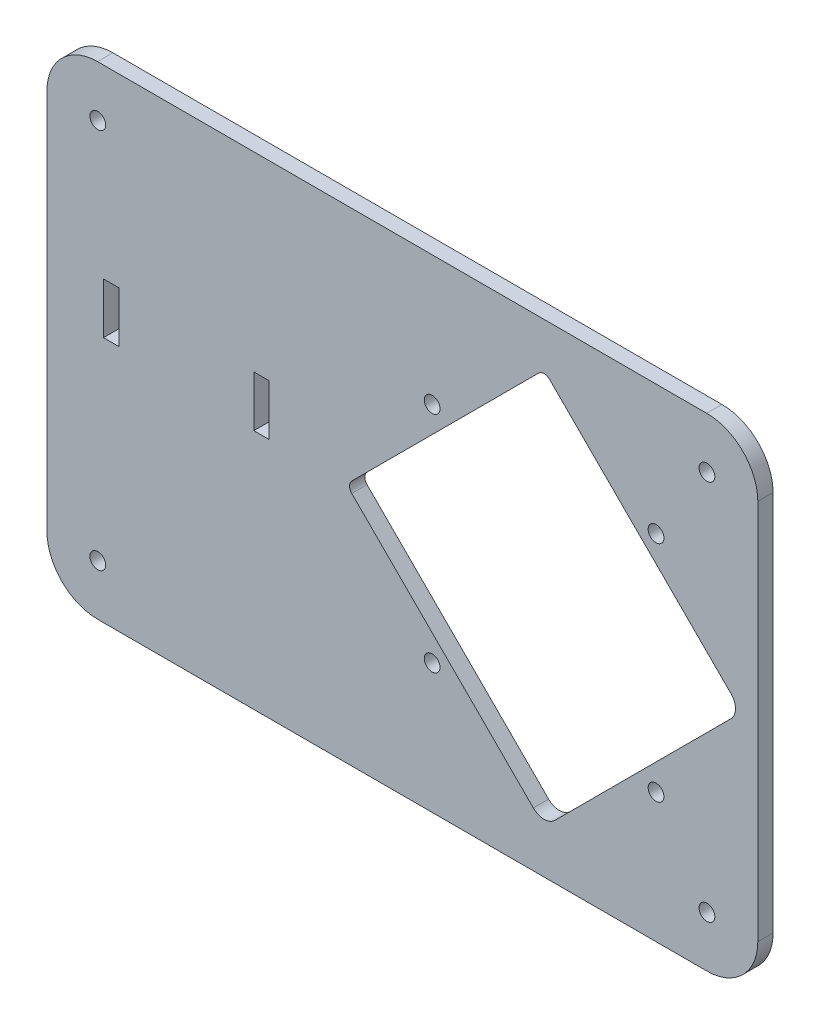
ISO-10303-21;
HEADER;
FILE_DESCRIPTION(('STEP AP214'),'2;1');
FILE_NAME('part.step','',(''),(''),'','','');
FILE_SCHEMA(('AUTOMOTIVE_DESIGN { 1 0 10303 214 1 1 1 1 }'));
ENDSEC;
DATA;
#1=APPLICATION_CONTEXT('core data for automotive mechanical design processes');
#2=APPLICATION_PROTOCOL_DEFINITION('international standard','automotive_design',2000,#1);
#3=PRODUCT_CONTEXT('',#1,'mechanical');
#4=PRODUCT('Part','Part','',(#3));
#5=PRODUCT_RELATED_PRODUCT_CATEGORY('part','',(#4));
#6=PRODUCT_DEFINITION_FORMATION('','',#4);
#7=PRODUCT_DEFINITION_CONTEXT('part definition',#1,'design');
#8=PRODUCT_DEFINITION('design','',#6,#7);
#9=PRODUCT_DEFINITION_SHAPE('','',#8);
#10=(LENGTH_UNIT() NAMED_UNIT(*) SI_UNIT(.MILLI.,.METRE.));
#11=(NAMED_UNIT(*) PLANE_ANGLE_UNIT() SI_UNIT($,.RADIAN.));
#12=(NAMED_UNIT(*) SI_UNIT($,.STERADIAN.) SOLID_ANGLE_UNIT());
#13=UNCERTAINTY_MEASURE_WITH_UNIT(LENGTH_MEASURE(1.E-05),#10,'distance_accuracy_value','');
#14=(GEOMETRIC_REPRESENTATION_CONTEXT(3) GLOBAL_UNCERTAINTY_ASSIGNED_CONTEXT((#13)) GLOBAL_UNIT_ASSIGNED_CONTEXT((#10,
#11,#12)) REPRESENTATION_CONTEXT('',''));
#15=CARTESIAN_POINT('',(0.,0.,0.));
#16=DIRECTION('',(0.,0.,1.));
#17=DIRECTION('',(1.,0.,0.));
#18=AXIS2_PLACEMENT_3D('',#15,#16,#17);
#19=CARTESIAN_POINT('',(15.6947795706554,1.1526691371013,3.));
#20=DIRECTION('',(0.,0.,1.));
#21=DIRECTION('',(1.,0.,0.));
#22=AXIS2_PLACEMENT_3D('',#19,#20,#21);
#23=PLANE('',#22);
#24=CARTESIAN_POINT('',(15.6947795706554,76.0577426574191,3.));
#25=DIRECTION('',(0.,0.,1.));
#26=DIRECTION('',(1.,0.,0.));
#27=AXIS2_PLACEMENT_3D('',#24,#25,#26);
#28=CIRCLE('',#27,1.55000000312162);
#29=CARTESIAN_POINT('',(17.244779573777,76.0577426574191,3.));
#30=VERTEX_POINT('',#29);
#31=EDGE_CURVE('E701',#30,#30,#28,.T.);
#32=ORIENTED_EDGE('',*,*,#31,.F.);
#33=EDGE_LOOP('',(#32));
#34=FACE_BOUND('',#33,.T.);
#35=CARTESIAN_POINT('',(135.394779570655,76.0577426574191,3.));
#36=DIRECTION('',(0.,0.,1.));
#37=DIRECTION('',(1.,0.,0.));
#38=AXIS2_PLACEMENT_3D('',#35,#36,#37);
#39=CIRCLE('',#38,1.55000000312162);
#40=CARTESIAN_POINT('',(136.944779573777,76.0577426574191,3.));
#41=VERTEX_POINT('',#40);
#42=EDGE_CURVE('E713',#41,#41,#39,.T.);
#43=ORIENTED_EDGE('',*,*,#42,.F.);
#44=EDGE_LOOP('',(#43));
#45=FACE_BOUND('',#44,.T.);
#46=CARTESIAN_POINT('',(125.394779569042,16.59999999969,3.));
#47=DIRECTION('',(0.,0.,1.));
#48=DIRECTION('',(1.,0.,0.));
#49=AXIS2_PLACEMENT_3D('',#46,#47,#48);
#50=CIRCLE('',#49,1.55000000161293);
#51=CARTESIAN_POINT('',(126.944779570655,16.59999999969,3.));
#52=VERTEX_POINT('',#51);
#53=EDGE_CURVE('E725',#52,#52,#50,.T.);
#54=ORIENTED_EDGE('',*,*,#53,.F.);
#55=EDGE_LOOP('',(#54));
#56=FACE_BOUND('',#55,.T.);
#57=CARTESIAN_POINT('',(81.3948795690424,16.5999999964642,3.));
#58=DIRECTION('',(0.,0.,1.));
#59=DIRECTION('',(1.,0.,0.));
#60=AXIS2_PLACEMENT_3D('',#57,#58,#59);
#61=CIRCLE('',#60,1.55000000161289);
#62=CARTESIAN_POINT('',(82.9448795706553,16.5999999964642,3.));
#63=VERTEX_POINT('',#62);
#64=EDGE_CURVE('E223',#63,#63,#61,.T.);
#65=ORIENTED_EDGE('',*,*,#64,.F.);
#66=EDGE_LOOP('',(#65));
#67=FACE_BOUND('',#66,.T.);
#68=CARTESIAN_POINT('',(15.6947795706554,1.1526691371013,3.));
#69=DIRECTION('',(0.,0.,1.));
#70=DIRECTION('',(1.,0.,0.));
#71=AXIS2_PLACEMENT_3D('',#68,#69,#70);
#72=CIRCLE('',#71,10.);
#73=CARTESIAN_POINT('',(5.69477957065543,1.15266913710129,3.));
#74=VERTEX_POINT('',#73);
#75=CARTESIAN_POINT('',(15.6947795706554,-8.84733086289874,3.));
#76=VERTEX_POINT('',#75);
#77=EDGE_CURVE('E323',#74,#76,#72,.T.);
#78=ORIENTED_EDGE('',*,*,#77,.T.);
#79=DIRECTION('',(1.,0.,0.));
#80=VECTOR('',#79,1.);
#81=CARTESIAN_POINT('',(15.6947795706554,-8.84733086289874,3.));
#82=LINE('',#81,#80);
#83=CARTESIAN_POINT('',(135.394779570655,-8.84733086289873,3.));
#84=VERTEX_POINT('',#83);
#85=EDGE_CURVE('E326',#76,#84,#82,.T.);
#86=ORIENTED_EDGE('',*,*,#85,.T.);
#87=CARTESIAN_POINT('',(135.394779570655,1.15266913710126,3.));
#88=DIRECTION('',(0.,0.,1.));
#89=DIRECTION('',(1.,0.,0.));
#90=AXIS2_PLACEMENT_3D('',#87,#88,#89);
#91=CIRCLE('',#90,9.99999999999999);
#92=CARTESIAN_POINT('',(145.394779570655,1.15266913710126,3.));
#93=VERTEX_POINT('',#92);
#94=EDGE_CURVE('E329',#84,#93,#91,.T.);
#95=ORIENTED_EDGE('',*,*,#94,.T.);
#96=DIRECTION('',(0.,1.,0.));
#97=VECTOR('',#96,1.);
#98=CARTESIAN_POINT('',(145.394779570655,76.0999776424039,3.));
#99=LINE('',#98,#97);
#100=CARTESIAN_POINT('',(145.394779570655,76.0999776424039,3.));
#101=VERTEX_POINT('',#100);
#102=EDGE_CURVE('E331',#93,#101,#99,.T.);
#103=ORIENTED_EDGE('',*,*,#102,.T.);
#104=CARTESIAN_POINT('',(135.394779570655,76.0577426574191,3.));
#105=DIRECTION('',(0.,0.,1.));
#106=DIRECTION('',(1.,0.,0.));
#107=AXIS2_PLACEMENT_3D('',#104,#105,#106);
#108=CIRCLE('',#107,10.0000891893001);
#109=CARTESIAN_POINT('',(135.352544585667,86.0577426574191,3.));
#110=VERTEX_POINT('',#109);
#111=EDGE_CURVE('E333',#101,#110,#108,.T.);
#112=ORIENTED_EDGE('',*,*,#111,.T.);
#113=DIRECTION('',(-1.,0.,0.));
#114=VECTOR('',#113,1.);
#115=CARTESIAN_POINT('',(15.6524445856688,86.0577426574191,3.));
#116=LINE('',#115,#114);
#117=CARTESIAN_POINT('',(15.6524445856688,86.0577426574191,3.));
#118=VERTEX_POINT('',#117);
#119=EDGE_CURVE('E335',#110,#118,#116,.T.);
#120=ORIENTED_EDGE('',*,*,#119,.T.);
#121=CARTESIAN_POINT('',(15.6947795706554,76.0577426574191,3.));
#122=DIRECTION('',(0.,0.,1.));
#123=DIRECTION('',(1.,0.,0.));
#124=AXIS2_PLACEMENT_3D('',#121,#122,#123);
#125=CIRCLE('',#124,10.0000896121462);
#126=CARTESIAN_POINT('',(5.69477957065542,76.1000776424078,3.));
#127=VERTEX_POINT('',#126);
#128=EDGE_CURVE('E337',#118,#127,#125,.T.);
#129=ORIENTED_EDGE('',*,*,#128,.T.);
#130=DIRECTION('',(0.,-1.,0.));
#131=VECTOR('',#130,1.);
#132=CARTESIAN_POINT('',(5.69477957065542,76.1000776424078,3.));
#133=LINE('',#132,#131);
#134=EDGE_CURVE('E339',#127,#74,#133,.T.);
#135=ORIENTED_EDGE('',*,*,#134,.T.);
#136=EDGE_LOOP('',(#78,#86,#95,#103,#112,#120,#129,#135));
#137=FACE_BOUND('',#136,.T.);
#138=DIRECTION('',(1.,0.,0.));
#139=VECTOR('',#138,1.);
#140=CARTESIAN_POINT('',(16.8158496285287,39.6610584653074,3.));
#141=LINE('',#140,#139);
#142=CARTESIAN_POINT('',(16.8158496285287,39.6610584653074,3.));
#143=VERTEX_POINT('',#142);
#144=CARTESIAN_POINT('',(19.8158496285287,39.6610584653074,3.));
#145=VERTEX_POINT('',#144);
#146=EDGE_CURVE('E294',#143,#145,#141,.T.);
#147=ORIENTED_EDGE('',*,*,#146,.F.);
#148=DIRECTION('',(0.,-1.,0.));
#149=VECTOR('',#148,1.);
#150=CARTESIAN_POINT('',(16.8158496285287,49.6610584653074,3.));
#151=LINE('',#150,#149);
#152=CARTESIAN_POINT('',(16.8158496285287,49.6610584653074,3.));
#153=VERTEX_POINT('',#152);
#154=EDGE_CURVE('E292',#153,#143,#151,.T.);
#155=ORIENTED_EDGE('',*,*,#154,.F.);
#156=DIRECTION('',(-1.,0.,0.));
#157=VECTOR('',#156,1.);
#158=CARTESIAN_POINT('',(16.8158496285287,49.6610584653074,3.));
#159=LINE('',#158,#157);
#160=CARTESIAN_POINT('',(19.8158496285287,49.6610584653074,3.));
#161=VERTEX_POINT('',#160);
#162=EDGE_CURVE('E300',#161,#153,#159,.T.);
#163=ORIENTED_EDGE('',*,*,#162,.F.);
#164=DIRECTION('',(0.,1.,0.));
#165=VECTOR('',#164,1.);
#166=CARTESIAN_POINT('',(19.8158496285287,49.6610584653074,3.));
#167=LINE('',#166,#165);
#168=EDGE_CURVE('E297',#145,#161,#167,.T.);
#169=ORIENTED_EDGE('',*,*,#168,.F.);
#170=EDGE_LOOP('',(#147,#155,#163,#169));
#171=FACE_BOUND('',#170,.T.);
#172=DIRECTION('',(0.707106781186547,0.707106781186548,0.));
#173=VECTOR('',#172,1.);
#174=CARTESIAN_POINT('',(105.516097101729,1.86631752915051,3.));
#175=LINE('',#174,#173);
#176=CARTESIAN_POINT('',(105.516097101729,1.86631752915051,3.));
#177=VERTEX_POINT('',#176);
#178=CARTESIAN_POINT('',(140.128859227096,36.4790796545173,3.));
#179=VERTEX_POINT('',#178);
#180=EDGE_CURVE('E235',#177,#179,#175,.T.);
#181=ORIENTED_EDGE('',*,*,#180,.F.);
#182=CARTESIAN_POINT('',(103.394776758169,3.98763787271016,3.));
#183=DIRECTION('',(0.,0.,1.));
#184=DIRECTION('',(1.,0.,0.));
#185=AXIS2_PLACEMENT_3D('',#182,#183,#184);
#186=CIRCLE('',#185,3.);
#187=CARTESIAN_POINT('',(101.273453005516,1.86632093824952,3.));
#188=VERTEX_POINT('',#187);
#189=EDGE_CURVE('E233',#188,#177,#186,.T.);
#190=ORIENTED_EDGE('',*,*,#189,.F.);
#191=DIRECTION('',(0.707105644820232,-0.707107917551037,0.));
#192=VECTOR('',#191,1.);
#193=CARTESIAN_POINT('',(101.273453005516,1.86632093824952,3.));
#194=LINE('',#193,#192);
#195=CARTESIAN_POINT('',(65.6001470716292,37.5397415308466,3.));
#196=VERTEX_POINT('',#195);
#197=EDGE_CURVE('E249',#196,#188,#194,.T.);
#198=ORIENTED_EDGE('',*,*,#197,.F.);
#199=CARTESIAN_POINT('',(66.6608089479557,38.600399998077,3.));
#200=DIRECTION('',(0.,0.,1.));
#201=DIRECTION('',(1.,0.,0.));
#202=AXIS2_PLACEMENT_3D('',#199,#200,#201);
#203=CIRCLE('',#202,1.49999999999999);
#204=CARTESIAN_POINT('',(65.6001470716292,39.6610584653074,3.));
#205=VERTEX_POINT('',#204);
#206=EDGE_CURVE('E246',#205,#196,#203,.T.);
#207=ORIENTED_EDGE('',*,*,#206,.F.);
#208=DIRECTION('',(-0.707105644820231,-0.707107917551037,0.));
#209=VECTOR('',#208,1.);
#210=CARTESIAN_POINT('',(65.6001470716292,39.6610584653074,3.));
#211=LINE('',#210,#209);
#212=CARTESIAN_POINT('',(102.334113177293,76.3951426387833,3.));
#213=VERTEX_POINT('',#212);
#214=EDGE_CURVE('E244',#213,#205,#211,.T.);
#215=ORIENTED_EDGE('',*,*,#214,.F.);
#216=CARTESIAN_POINT('',(103.39477505362,75.334484171553,3.));
#217=DIRECTION('',(0.,0.,1.));
#218=DIRECTION('',(1.,0.,0.));
#219=AXIS2_PLACEMENT_3D('',#216,#217,#218);
#220=CIRCLE('',#219,1.50000000000001);
#221=CARTESIAN_POINT('',(104.4554352254,76.3951443433329,3.));
#222=VERTEX_POINT('',#221);
#223=EDGE_CURVE('E242',#222,#213,#220,.T.);
#224=ORIENTED_EDGE('',*,*,#223,.F.);
#225=DIRECTION('',(-0.707106781186548,0.707106781186547,0.));
#226=VECTOR('',#225,1.);
#227=CARTESIAN_POINT('',(140.128859227096,40.7217203416366,3.));
#228=LINE('',#227,#226);
#229=CARTESIAN_POINT('',(140.128859227096,40.7217203416366,3.));
#230=VERTEX_POINT('',#229);
#231=EDGE_CURVE('E240',#230,#222,#228,.T.);
#232=ORIENTED_EDGE('',*,*,#231,.F.);
#233=CARTESIAN_POINT('',(138.007538883536,38.6003999980771,3.));
#234=DIRECTION('',(0.,0.,1.));
#235=DIRECTION('',(1.,0.,0.));
#236=AXIS2_PLACEMENT_3D('',#233,#234,#235);
#237=CIRCLE('',#236,3.);
#238=EDGE_CURVE('E238',#179,#230,#237,.T.);
#239=ORIENTED_EDGE('',*,*,#238,.F.);
#240=EDGE_LOOP('',(#181,#190,#198,#207,#215,#224,#232,#239));
#241=FACE_BOUND('',#240,.T.);
#242=DIRECTION('',(1.,0.,0.));
#243=VECTOR('',#242,1.);
#244=CARTESIAN_POINT('',(46.3485605389878,38.600399998077,3.));
#245=LINE('',#244,#243);
#246=CARTESIAN_POINT('',(46.3485605389878,38.600399998077,3.));
#247=VERTEX_POINT('',#246);
#248=CARTESIAN_POINT('',(49.3485605389878,38.600399998077,3.));
#249=VERTEX_POINT('',#248);
#250=EDGE_CURVE('E202',#247,#249,#245,.T.);
#251=ORIENTED_EDGE('',*,*,#250,.F.);
#252=DIRECTION('',(0.,-1.,0.));
#253=VECTOR('',#252,1.);
#254=CARTESIAN_POINT('',(46.3485605389878,48.600399998077,3.));
#255=LINE('',#254,#253);
#256=CARTESIAN_POINT('',(46.3485605389878,48.600399998077,3.));
#257=VERTEX_POINT('',#256);
#258=EDGE_CURVE('E194',#257,#247,#255,.T.);
#259=ORIENTED_EDGE('',*,*,#258,.F.);
#260=DIRECTION('',(-1.,0.,0.));
#261=VECTOR('',#260,1.);
#262=CARTESIAN_POINT('',(46.3485605389878,48.600399998077,3.));
#263=LINE('',#262,#261);
#264=CARTESIAN_POINT('',(49.3485605389878,48.600399998077,3.));
#265=VERTEX_POINT('',#264);
#266=EDGE_CURVE('E217',#265,#257,#263,.T.);
#267=ORIENTED_EDGE('',*,*,#266,.F.);
#268=DIRECTION('',(0.,1.,0.));
#269=VECTOR('',#268,1.);
#270=CARTESIAN_POINT('',(49.3485605389878,48.600399998077,3.));
#271=LINE('',#270,#269);
#272=EDGE_CURVE('E215',#249,#265,#271,.T.);
#273=ORIENTED_EDGE('',*,*,#272,.F.);
#274=EDGE_LOOP('',(#251,#259,#267,#273));
#275=FACE_BOUND('',#274,.T.);
#276=CARTESIAN_POINT('',(81.3947295748109,60.600050001613,3.));
#277=DIRECTION('',(0.,0.,1.));
#278=DIRECTION('',(1.,0.,0.));
#279=AXIS2_PLACEMENT_3D('',#276,#277,#278);
#280=CIRCLE('',#279,1.5500000016129);
#281=CARTESIAN_POINT('',(82.9447295764238,60.600050001613,3.));
#282=VERTEX_POINT('',#281);
#283=EDGE_CURVE('E731',#282,#282,#280,.T.);
#284=ORIENTED_EDGE('',*,*,#283,.F.);
#285=EDGE_LOOP('',(#284));
#286=FACE_BOUND('',#285,.T.);
#287=CARTESIAN_POINT('',(125.394879569042,60.5999999964642,3.));
#288=DIRECTION('',(0.,0.,1.));
#289=DIRECTION('',(1.,0.,0.));
#290=AXIS2_PLACEMENT_3D('',#287,#288,#289);
#291=CIRCLE('',#290,1.55000000161284);
#292=CARTESIAN_POINT('',(126.944879570655,60.5999999964642,3.));
#293=VERTEX_POINT('',#292);
#294=EDGE_CURVE('E719',#293,#293,#291,.T.);
#295=ORIENTED_EDGE('',*,*,#294,.F.);
#296=EDGE_LOOP('',(#295));
#297=FACE_BOUND('',#296,.T.);
#298=CARTESIAN_POINT('',(135.394779570655,1.15266913710126,3.));
#299=DIRECTION('',(0.,0.,1.));
#300=DIRECTION('',(1.,0.,0.));
#301=AXIS2_PLACEMENT_3D('',#298,#299,#300);
#302=CIRCLE('',#301,1.55000000312165);
#303=CARTESIAN_POINT('',(136.944779573777,1.15266913710126,3.));
#304=VERTEX_POINT('',#303);
#305=EDGE_CURVE('E707',#304,#304,#302,.T.);
#306=ORIENTED_EDGE('',*,*,#305,.F.);
#307=EDGE_LOOP('',(#306));
#308=FACE_BOUND('',#307,.T.);
#309=CARTESIAN_POINT('',(15.6947795706554,1.1526691371013,3.));
#310=DIRECTION('',(0.,0.,1.));
#311=DIRECTION('',(1.,0.,0.));
#312=AXIS2_PLACEMENT_3D('',#309,#310,#311);
#313=CIRCLE('',#312,1.55);
#314=CARTESIAN_POINT('',(17.2447795706554,1.1526691371013,3.));
#315=VERTEX_POINT('',#314);
#316=EDGE_CURVE('E692',#315,#315,#313,.T.);
#317=ORIENTED_EDGE('',*,*,#316,.F.);
#318=EDGE_LOOP('',(#317));
#319=FACE_BOUND('',#318,.T.);
#320=ADVANCED_FACE('F33',(#34,#45,#56,#67,#137,#171,#241,#275,#286,#297,#308,#319),#23,.T.);
#321=CARTESIAN_POINT('',(15.6947795706554,1.1526691371013,0.));
#322=DIRECTION('',(0.,0.,1.));
#323=DIRECTION('',(1.,0.,0.));
#324=AXIS2_PLACEMENT_3D('',#321,#322,#323);
#325=PLANE('',#324);
#326=CARTESIAN_POINT('',(103.394776758169,3.98763787271016,0.));
#327=DIRECTION('',(0.,0.,1.));
#328=DIRECTION('',(1.,0.,0.));
#329=AXIS2_PLACEMENT_3D('',#326,#327,#328);
#330=CIRCLE('',#329,3.);
#331=CARTESIAN_POINT('',(101.273453005516,1.86632093824952,0.));
#332=VERTEX_POINT('',#331);
#333=CARTESIAN_POINT('',(105.516097101729,1.86631752915051,0.));
#334=VERTEX_POINT('',#333);
#335=EDGE_CURVE('E210',#332,#334,#330,.T.);
#336=ORIENTED_EDGE('',*,*,#335,.T.);
#337=DIRECTION('',(0.707106781186547,0.707106781186548,0.));
#338=VECTOR('',#337,1.);
#339=CARTESIAN_POINT('',(105.516097101729,1.86631752915051,0.));
#340=LINE('',#339,#338);
#341=CARTESIAN_POINT('',(140.128859227096,36.4790796545173,0.));
#342=VERTEX_POINT('',#341);
#343=EDGE_CURVE('E254',#334,#342,#340,.T.);
#344=ORIENTED_EDGE('',*,*,#343,.T.);
#345=CARTESIAN_POINT('',(138.007538883536,38.6003999980771,0.));
#346=DIRECTION('',(0.,0.,1.));
#347=DIRECTION('',(1.,0.,0.));
#348=AXIS2_PLACEMENT_3D('',#345,#346,#347);
#349=CIRCLE('',#348,3.);
#350=CARTESIAN_POINT('',(140.128859227096,40.7217203416366,0.));
#351=VERTEX_POINT('',#350);
#352=EDGE_CURVE('E257',#342,#351,#349,.T.);
#353=ORIENTED_EDGE('',*,*,#352,.T.);
#354=DIRECTION('',(-0.707106781186548,0.707106781186547,0.));
#355=VECTOR('',#354,1.);
#356=CARTESIAN_POINT('',(140.128859227096,40.7217203416366,0.));
#357=LINE('',#356,#355);
#358=CARTESIAN_POINT('',(104.4554352254,76.3951443433329,0.));
#359=VERTEX_POINT('',#358);
#360=EDGE_CURVE('E260',#351,#359,#357,.T.);
#361=ORIENTED_EDGE('',*,*,#360,.T.);
#362=CARTESIAN_POINT('',(103.39477505362,75.334484171553,0.));
#363=DIRECTION('',(0.,0.,1.));
#364=DIRECTION('',(1.,0.,0.));
#365=AXIS2_PLACEMENT_3D('',#362,#363,#364);
#366=CIRCLE('',#365,1.50000000000001);
#367=CARTESIAN_POINT('',(102.334113177293,76.3951426387833,0.));
#368=VERTEX_POINT('',#367);
#369=EDGE_CURVE('E263',#359,#368,#366,.T.);
#370=ORIENTED_EDGE('',*,*,#369,.T.);
#371=DIRECTION('',(-0.707105644820231,-0.707107917551037,0.));
#372=VECTOR('',#371,1.);
#373=CARTESIAN_POINT('',(65.6001470716292,39.6610584653074,0.));
#374=LINE('',#373,#372);
#375=CARTESIAN_POINT('',(65.6001470716292,39.6610584653074,0.));
#376=VERTEX_POINT('',#375);
#377=EDGE_CURVE('E266',#368,#376,#374,.T.);
#378=ORIENTED_EDGE('',*,*,#377,.T.);
#379=CARTESIAN_POINT('',(66.6608089479557,38.600399998077,0.));
#380=DIRECTION('',(0.,0.,1.));
#381=DIRECTION('',(1.,0.,0.));
#382=AXIS2_PLACEMENT_3D('',#379,#380,#381);
#383=CIRCLE('',#382,1.49999999999999);
#384=CARTESIAN_POINT('',(65.6001470716292,37.5397415308466,0.));
#385=VERTEX_POINT('',#384);
#386=EDGE_CURVE('E269',#376,#385,#383,.T.);
#387=ORIENTED_EDGE('',*,*,#386,.T.);
#388=DIRECTION('',(0.707105644820232,-0.707107917551037,0.));
#389=VECTOR('',#388,1.);
#390=CARTESIAN_POINT('',(101.273453005516,1.86632093824952,0.));
#391=LINE('',#390,#389);
#392=EDGE_CURVE('E236',#385,#332,#391,.T.);
#393=ORIENTED_EDGE('',*,*,#392,.T.);
#394=EDGE_LOOP('',(#336,#344,#353,#361,#370,#378,#387,#393));
#395=FACE_BOUND('',#394,.T.);
#396=CARTESIAN_POINT('',(15.6947795706554,1.1526691371013,0.));
#397=DIRECTION('',(0.,0.,1.));
#398=DIRECTION('',(1.,0.,0.));
#399=AXIS2_PLACEMENT_3D('',#396,#397,#398);
#400=CIRCLE('',#399,10.);
#401=CARTESIAN_POINT('',(5.69477957065543,1.15266913710129,0.));
#402=VERTEX_POINT('',#401);
#403=CARTESIAN_POINT('',(15.6947795706554,-8.84733086289874,0.));
#404=VERTEX_POINT('',#403);
#405=EDGE_CURVE('E322',#402,#404,#400,.T.);
#406=ORIENTED_EDGE('',*,*,#405,.F.);
#407=DIRECTION('',(0.,-1.,0.));
#408=VECTOR('',#407,1.);
#409=CARTESIAN_POINT('',(5.69477957065542,76.1000776424078,0.));
#410=LINE('',#409,#408);
#411=CARTESIAN_POINT('',(5.69477957065542,76.1000776424078,0.));
#412=VERTEX_POINT('',#411);
#413=EDGE_CURVE('E327',#412,#402,#410,.T.);
#414=ORIENTED_EDGE('',*,*,#413,.F.);
#415=CARTESIAN_POINT('',(15.6947795706554,76.0577426574191,0.));
#416=DIRECTION('',(0.,0.,1.));
#417=DIRECTION('',(1.,0.,0.));
#418=AXIS2_PLACEMENT_3D('',#415,#416,#417);
#419=CIRCLE('',#418,10.0000896121462);
#420=CARTESIAN_POINT('',(15.6524445856688,86.0577426574191,0.));
#421=VERTEX_POINT('',#420);
#422=EDGE_CURVE('E354',#421,#412,#419,.T.);
#423=ORIENTED_EDGE('',*,*,#422,.F.);
#424=DIRECTION('',(-1.,0.,0.));
#425=VECTOR('',#424,1.);
#426=CARTESIAN_POINT('',(15.6524445856688,86.0577426574191,0.));
#427=LINE('',#426,#425);
#428=CARTESIAN_POINT('',(135.352544585667,86.0577426574191,0.));
#429=VERTEX_POINT('',#428);
#430=EDGE_CURVE('E352',#429,#421,#427,.T.);
#431=ORIENTED_EDGE('',*,*,#430,.F.);
#432=CARTESIAN_POINT('',(135.394779570655,76.0577426574191,0.));
#433=DIRECTION('',(0.,0.,1.));
#434=DIRECTION('',(1.,0.,0.));
#435=AXIS2_PLACEMENT_3D('',#432,#433,#434);
#436=CIRCLE('',#435,10.0000891893001);
#437=CARTESIAN_POINT('',(145.394779570655,76.0999776424039,0.));
#438=VERTEX_POINT('',#437);
#439=EDGE_CURVE('E350',#438,#429,#436,.T.);
#440=ORIENTED_EDGE('',*,*,#439,.F.);
#441=DIRECTION('',(0.,1.,0.));
#442=VECTOR('',#441,1.);
#443=CARTESIAN_POINT('',(145.394779570655,76.0999776424039,0.));
#444=LINE('',#443,#442);
#445=CARTESIAN_POINT('',(145.394779570655,1.15266913710126,0.));
#446=VERTEX_POINT('',#445);
#447=EDGE_CURVE('E348',#446,#438,#444,.T.);
#448=ORIENTED_EDGE('',*,*,#447,.F.);
#449=CARTESIAN_POINT('',(135.394779570655,1.15266913710126,0.));
#450=DIRECTION('',(0.,0.,1.));
#451=DIRECTION('',(1.,0.,0.));
#452=AXIS2_PLACEMENT_3D('',#449,#450,#451);
#453=CIRCLE('',#452,9.99999999999999);
#454=CARTESIAN_POINT('',(135.394779570655,-8.84733086289873,0.));
#455=VERTEX_POINT('',#454);
#456=EDGE_CURVE('E346',#455,#446,#453,.T.);
#457=ORIENTED_EDGE('',*,*,#456,.F.);
#458=DIRECTION('',(1.,0.,0.));
#459=VECTOR('',#458,1.);
#460=CARTESIAN_POINT('',(15.6947795706554,-8.84733086289874,0.));
#461=LINE('',#460,#459);
#462=EDGE_CURVE('E344',#404,#455,#461,.T.);
#463=ORIENTED_EDGE('',*,*,#462,.F.);
#464=EDGE_LOOP('',(#406,#414,#423,#431,#440,#448,#457,#463));
#465=FACE_BOUND('',#464,.T.);
#466=DIRECTION('',(0.,-1.,0.));
#467=VECTOR('',#466,1.);
#468=CARTESIAN_POINT('',(16.8158496285287,49.6610584653074,0.));
#469=LINE('',#468,#467);
#470=CARTESIAN_POINT('',(16.8158496285287,49.6610584653074,0.));
#471=VERTEX_POINT('',#470);
#472=CARTESIAN_POINT('',(16.8158496285287,39.6610584653074,0.));
#473=VERTEX_POINT('',#472);
#474=EDGE_CURVE('E291',#471,#473,#469,.T.);
#475=ORIENTED_EDGE('',*,*,#474,.T.);
#476=DIRECTION('',(1.,0.,0.));
#477=VECTOR('',#476,1.);
#478=CARTESIAN_POINT('',(16.8158496285287,39.6610584653074,0.));
#479=LINE('',#478,#477);
#480=CARTESIAN_POINT('',(19.8158496285287,39.6610584653074,0.));
#481=VERTEX_POINT('',#480);
#482=EDGE_CURVE('E305',#473,#481,#479,.T.);
#483=ORIENTED_EDGE('',*,*,#482,.T.);
#484=DIRECTION('',(0.,1.,0.));
#485=VECTOR('',#484,1.);
#486=CARTESIAN_POINT('',(19.8158496285287,49.6610584653074,0.));
#487=LINE('',#486,#485);
#488=CARTESIAN_POINT('',(19.8158496285287,49.6610584653074,0.));
#489=VERTEX_POINT('',#488);
#490=EDGE_CURVE('E308',#481,#489,#487,.T.);
#491=ORIENTED_EDGE('',*,*,#490,.T.);
#492=DIRECTION('',(-1.,0.,0.));
#493=VECTOR('',#492,1.);
#494=CARTESIAN_POINT('',(16.8158496285287,49.6610584653074,0.));
#495=LINE('',#494,#493);
#496=EDGE_CURVE('E295',#489,#471,#495,.T.);
#497=ORIENTED_EDGE('',*,*,#496,.T.);
#498=EDGE_LOOP('',(#475,#483,#491,#497));
#499=FACE_BOUND('',#498,.T.);
#500=DIRECTION('',(0.,-1.,0.));
#501=VECTOR('',#500,1.);
#502=CARTESIAN_POINT('',(46.3485605389878,48.600399998077,0.));
#503=LINE('',#502,#501);
#504=CARTESIAN_POINT('',(46.3485605389878,48.600399998077,0.));
#505=VERTEX_POINT('',#504);
#506=CARTESIAN_POINT('',(46.3485605389878,38.600399998077,0.));
#507=VERTEX_POINT('',#506);
#508=EDGE_CURVE('E56',#505,#507,#503,.T.);
#509=ORIENTED_EDGE('',*,*,#508,.T.);
#510=DIRECTION('',(1.,0.,0.));
#511=VECTOR('',#510,1.);
#512=CARTESIAN_POINT('',(46.3485605389878,38.600399998077,0.));
#513=LINE('',#512,#511);
#514=CARTESIAN_POINT('',(49.3485605389878,38.600399998077,0.));
#515=VERTEX_POINT('',#514);
#516=EDGE_CURVE('E209',#507,#515,#513,.T.);
#517=ORIENTED_EDGE('',*,*,#516,.T.);
#518=DIRECTION('',(0.,1.,0.));
#519=VECTOR('',#518,1.);
#520=CARTESIAN_POINT('',(49.3485605389878,48.600399998077,0.));
#521=LINE('',#520,#519);
#522=CARTESIAN_POINT('',(49.3485605389878,48.600399998077,0.));
#523=VERTEX_POINT('',#522);
#524=EDGE_CURVE('E225',#515,#523,#521,.T.);
#525=ORIENTED_EDGE('',*,*,#524,.T.);
#526=DIRECTION('',(-1.,0.,0.));
#527=VECTOR('',#526,1.);
#528=CARTESIAN_POINT('',(46.3485605389878,48.600399998077,0.));
#529=LINE('',#528,#527);
#530=EDGE_CURVE('E203',#523,#505,#529,.T.);
#531=ORIENTED_EDGE('',*,*,#530,.T.);
#532=EDGE_LOOP('',(#509,#517,#525,#531));
#533=FACE_BOUND('',#532,.T.);
#534=CARTESIAN_POINT('',(81.3948795690424,16.5999999964642,0.));
#535=DIRECTION('',(0.,0.,1.));
#536=DIRECTION('',(1.,0.,0.));
#537=AXIS2_PLACEMENT_3D('',#534,#535,#536);
#538=CIRCLE('',#537,1.55000000161289);
#539=CARTESIAN_POINT('',(82.9448795706553,16.5999999964642,0.));
#540=VERTEX_POINT('',#539);
#541=EDGE_CURVE('E734',#540,#540,#538,.T.);
#542=ORIENTED_EDGE('',*,*,#541,.T.);
#543=EDGE_LOOP('',(#542));
#544=FACE_BOUND('',#543,.T.);
#545=CARTESIAN_POINT('',(81.3947295748109,60.600050001613,0.));
#546=DIRECTION('',(0.,0.,1.));
#547=DIRECTION('',(1.,0.,0.));
#548=AXIS2_PLACEMENT_3D('',#545,#546,#547);
#549=CIRCLE('',#548,1.5500000016129);
#550=CARTESIAN_POINT('',(82.9447295764238,60.600050001613,0.));
#551=VERTEX_POINT('',#550);
#552=EDGE_CURVE('E728',#551,#551,#549,.T.);
#553=ORIENTED_EDGE('',*,*,#552,.T.);
#554=EDGE_LOOP('',(#553));
#555=FACE_BOUND('',#554,.T.);
#556=CARTESIAN_POINT('',(125.394779569042,16.59999999969,0.));
#557=DIRECTION('',(0.,0.,1.));
#558=DIRECTION('',(1.,0.,0.));
#559=AXIS2_PLACEMENT_3D('',#556,#557,#558);
#560=CIRCLE('',#559,1.55000000161293);
#561=CARTESIAN_POINT('',(126.944779570655,16.59999999969,0.));
#562=VERTEX_POINT('',#561);
#563=EDGE_CURVE('E722',#562,#562,#560,.T.);
#564=ORIENTED_EDGE('',*,*,#563,.T.);
#565=EDGE_LOOP('',(#564));
#566=FACE_BOUND('',#565,.T.);
#567=CARTESIAN_POINT('',(125.394879569042,60.5999999964642,0.));
#568=DIRECTION('',(0.,0.,1.));
#569=DIRECTION('',(1.,0.,0.));
#570=AXIS2_PLACEMENT_3D('',#567,#568,#569);
#571=CIRCLE('',#570,1.55000000161284);
#572=CARTESIAN_POINT('',(126.944879570655,60.5999999964642,0.));
#573=VERTEX_POINT('',#572);
#574=EDGE_CURVE('E716',#573,#573,#571,.T.);
#575=ORIENTED_EDGE('',*,*,#574,.T.);
#576=EDGE_LOOP('',(#575));
#577=FACE_BOUND('',#576,.T.);
#578=CARTESIAN_POINT('',(135.394779570655,76.0577426574191,0.));
#579=DIRECTION('',(0.,0.,1.));
#580=DIRECTION('',(1.,0.,0.));
#581=AXIS2_PLACEMENT_3D('',#578,#579,#580);
#582=CIRCLE('',#581,1.55000000312162);
#583=CARTESIAN_POINT('',(136.944779573777,76.0577426574191,0.));
#584=VERTEX_POINT('',#583);
#585=EDGE_CURVE('E710',#584,#584,#582,.T.);
#586=ORIENTED_EDGE('',*,*,#585,.T.);
#587=EDGE_LOOP('',(#586));
#588=FACE_BOUND('',#587,.T.);
#589=CARTESIAN_POINT('',(135.394779570655,1.15266913710126,0.));
#590=DIRECTION('',(0.,0.,1.));
#591=DIRECTION('',(1.,0.,0.));
#592=AXIS2_PLACEMENT_3D('',#589,#590,#591);
#593=CIRCLE('',#592,1.55000000312165);
#594=CARTESIAN_POINT('',(136.944779573777,1.15266913710126,0.));
#595=VERTEX_POINT('',#594);
#596=EDGE_CURVE('E704',#595,#595,#593,.T.);
#597=ORIENTED_EDGE('',*,*,#596,.T.);
#598=EDGE_LOOP('',(#597));
#599=FACE_BOUND('',#598,.T.);
#600=CARTESIAN_POINT('',(15.6947795706554,76.0577426574191,0.));
#601=DIRECTION('',(0.,0.,1.));
#602=DIRECTION('',(1.,0.,0.));
#603=AXIS2_PLACEMENT_3D('',#600,#601,#602);
#604=CIRCLE('',#603,1.55000000312162);
#605=CARTESIAN_POINT('',(17.244779573777,76.0577426574191,0.));
#606=VERTEX_POINT('',#605);
#607=EDGE_CURVE('E698',#606,#606,#604,.T.);
#608=ORIENTED_EDGE('',*,*,#607,.T.);
#609=EDGE_LOOP('',(#608));
#610=FACE_BOUND('',#609,.T.);
#611=CARTESIAN_POINT('',(15.6947795706554,1.1526691371013,0.));
#612=DIRECTION('',(0.,0.,1.));
#613=DIRECTION('',(1.,0.,0.));
#614=AXIS2_PLACEMENT_3D('',#611,#612,#613);
#615=CIRCLE('',#614,1.55);
#616=CARTESIAN_POINT('',(17.2447795706554,1.1526691371013,0.));
#617=VERTEX_POINT('',#616);
#618=EDGE_CURVE('E695',#617,#617,#615,.T.);
#619=ORIENTED_EDGE('',*,*,#618,.T.);
#620=EDGE_LOOP('',(#619));
#621=FACE_BOUND('',#620,.T.);
#622=ADVANCED_FACE('F384',(#395,#465,#499,#533,#544,#555,#566,#577,#588,#599,#610,#621),#325,.F.);
#623=CARTESIAN_POINT('',(15.6947795706554,1.1526691371013,3.));
#624=DIRECTION('',(0.,0.,-1.));
#625=DIRECTION('',(-1.,0.,0.));
#626=AXIS2_PLACEMENT_3D('',#623,#624,#625);
#627=CYLINDRICAL_SURFACE('',#626,10.);
#628=ORIENTED_EDGE('',*,*,#405,.T.);
#629=DIRECTION('',(0.,0.,-1.));
#630=VECTOR('',#629,1.);
#631=CARTESIAN_POINT('',(15.6947795706554,-8.84733086289874,3.));
#632=LINE('',#631,#630);
#633=EDGE_CURVE('E11',#76,#404,#632,.T.);
#634=ORIENTED_EDGE('',*,*,#633,.F.);
#635=ORIENTED_EDGE('',*,*,#77,.F.);
#636=DIRECTION('',(0.,0.,-1.));
#637=VECTOR('',#636,1.);
#638=CARTESIAN_POINT('',(5.69477957065543,1.15266913710129,3.));
#639=LINE('',#638,#637);
#640=EDGE_CURVE('E341',#74,#402,#639,.T.);
#641=ORIENTED_EDGE('',*,*,#640,.T.);
#642=EDGE_LOOP('',(#628,#634,#635,#641));
#643=FACE_BOUND('',#642,.T.);
#644=ADVANCED_FACE('F35',(#643),#627,.T.);
#645=CARTESIAN_POINT('',(15.6947795706554,-8.84733086289874,3.));
#646=DIRECTION('',(0.,1.,0.));
#647=DIRECTION('',(-1.,0.,0.));
#648=AXIS2_PLACEMENT_3D('',#645,#646,#647);
#649=PLANE('',#648);
#650=ORIENTED_EDGE('',*,*,#462,.T.);
#651=DIRECTION('',(0.,0.,-1.));
#652=VECTOR('',#651,1.);
#653=CARTESIAN_POINT('',(135.394779570655,-8.84733086289873,3.));
#654=LINE('',#653,#652);
#655=EDGE_CURVE('E41',#84,#455,#654,.T.);
#656=ORIENTED_EDGE('',*,*,#655,.F.);
#657=ORIENTED_EDGE('',*,*,#85,.F.);
#658=ORIENTED_EDGE('',*,*,#633,.T.);
#659=EDGE_LOOP('',(#650,#656,#657,#658));
#660=FACE_BOUND('',#659,.T.);
#661=ADVANCED_FACE('F402',(#660),#649,.F.);
#662=CARTESIAN_POINT('',(135.394779570655,1.15266913710126,3.));
#663=DIRECTION('',(0.,0.,-1.));
#664=DIRECTION('',(-1.,0.,0.));
#665=AXIS2_PLACEMENT_3D('',#662,#663,#664);
#666=CYLINDRICAL_SURFACE('',#665,9.99999999999999);
#667=ORIENTED_EDGE('',*,*,#456,.T.);
#668=DIRECTION('',(0.,0.,-1.));
#669=VECTOR('',#668,1.);
#670=CARTESIAN_POINT('',(145.394779570655,1.15266913710126,3.));
#671=LINE('',#670,#669);
#672=EDGE_CURVE('E371',#93,#446,#671,.T.);
#673=ORIENTED_EDGE('',*,*,#672,.F.);
#674=ORIENTED_EDGE('',*,*,#94,.F.);
#675=ORIENTED_EDGE('',*,*,#655,.T.);
#676=EDGE_LOOP('',(#667,#673,#674,#675));
#677=FACE_BOUND('',#676,.T.);
#678=ADVANCED_FACE('F378',(#677),#666,.T.);
#679=CARTESIAN_POINT('',(145.394779570655,76.0999776424039,3.));
#680=DIRECTION('',(-1.,0.,0.));
#681=DIRECTION('',(0.,-1.,0.));
#682=AXIS2_PLACEMENT_3D('',#679,#680,#681);
#683=PLANE('',#682);
#684=ORIENTED_EDGE('',*,*,#447,.T.);
#685=DIRECTION('',(0.,0.,-1.));
#686=VECTOR('',#685,1.);
#687=CARTESIAN_POINT('',(145.394779570655,76.0999776424039,3.));
#688=LINE('',#687,#686);
#689=EDGE_CURVE('E368',#101,#438,#688,.T.);
#690=ORIENTED_EDGE('',*,*,#689,.F.);
#691=ORIENTED_EDGE('',*,*,#102,.F.);
#692=ORIENTED_EDGE('',*,*,#672,.T.);
#693=EDGE_LOOP('',(#684,#690,#691,#692));
#694=FACE_BOUND('',#693,.T.);
#695=ADVANCED_FACE('F390',(#694),#683,.F.);
#696=CARTESIAN_POINT('',(135.394779570655,76.0577426574191,3.));
#697=DIRECTION('',(0.,0.,-1.));
#698=DIRECTION('',(-1.,0.,0.));
#699=AXIS2_PLACEMENT_3D('',#696,#697,#698);
#700=CYLINDRICAL_SURFACE('',#699,10.0000891893001);
#701=ORIENTED_EDGE('',*,*,#439,.T.);
#702=DIRECTION('',(0.,0.,-1.));
#703=VECTOR('',#702,1.);
#704=CARTESIAN_POINT('',(135.352544585667,86.0577426574191,3.));
#705=LINE('',#704,#703);
#706=EDGE_CURVE('E365',#110,#429,#705,.T.);
#707=ORIENTED_EDGE('',*,*,#706,.F.);
#708=ORIENTED_EDGE('',*,*,#111,.F.);
#709=ORIENTED_EDGE('',*,*,#689,.T.);
#710=EDGE_LOOP('',(#701,#707,#708,#709));
#711=FACE_BOUND('',#710,.T.);
#712=ADVANCED_FACE('F394',(#711),#700,.T.);
#713=CARTESIAN_POINT('',(15.6524445856688,86.0577426574191,3.));
#714=DIRECTION('',(0.,-1.,0.));
#715=DIRECTION('',(0.,0.,-1.));
#716=AXIS2_PLACEMENT_3D('',#713,#714,#715);
#717=PLANE('',#716);
#718=ORIENTED_EDGE('',*,*,#430,.T.);
#719=DIRECTION('',(0.,0.,-1.));
#720=VECTOR('',#719,1.);
#721=CARTESIAN_POINT('',(15.6524445856688,86.0577426574191,3.));
#722=LINE('',#721,#720);
#723=EDGE_CURVE('E362',#118,#421,#722,.T.);
#724=ORIENTED_EDGE('',*,*,#723,.F.);
#725=ORIENTED_EDGE('',*,*,#119,.F.);
#726=ORIENTED_EDGE('',*,*,#706,.T.);
#727=EDGE_LOOP('',(#718,#724,#725,#726));
#728=FACE_BOUND('',#727,.T.);
#729=ADVANCED_FACE('F415',(#728),#717,.F.);
#730=CARTESIAN_POINT('',(15.6947795706554,76.0577426574191,3.));
#731=DIRECTION('',(0.,0.,-1.));
#732=DIRECTION('',(-1.,0.,0.));
#733=AXIS2_PLACEMENT_3D('',#730,#731,#732);
#734=CYLINDRICAL_SURFACE('',#733,10.0000896121462);
#735=ORIENTED_EDGE('',*,*,#422,.T.);
#736=DIRECTION('',(0.,0.,-1.));
#737=VECTOR('',#736,1.);
#738=CARTESIAN_POINT('',(5.69477957065542,76.1000776424078,3.));
#739=LINE('',#738,#737);
#740=EDGE_CURVE('E359',#127,#412,#739,.T.);
#741=ORIENTED_EDGE('',*,*,#740,.F.);
#742=ORIENTED_EDGE('',*,*,#128,.F.);
#743=ORIENTED_EDGE('',*,*,#723,.T.);
#744=EDGE_LOOP('',(#735,#741,#742,#743));
#745=FACE_BOUND('',#744,.T.);
#746=ADVANCED_FACE('F413',(#745),#734,.T.);
#747=CARTESIAN_POINT('',(5.69477957065542,76.1000776424078,3.));
#748=DIRECTION('',(1.,0.,0.));
#749=DIRECTION('',(0.,1.,0.));
#750=AXIS2_PLACEMENT_3D('',#747,#748,#749);
#751=PLANE('',#750);
#752=ORIENTED_EDGE('',*,*,#413,.T.);
#753=ORIENTED_EDGE('',*,*,#640,.F.);
#754=ORIENTED_EDGE('',*,*,#134,.F.);
#755=ORIENTED_EDGE('',*,*,#740,.T.);
#756=EDGE_LOOP('',(#752,#753,#754,#755));
#757=FACE_BOUND('',#756,.T.);
#758=ADVANCED_FACE('F408',(#757),#751,.F.);
#759=CARTESIAN_POINT('',(16.8158496285287,49.6610584653074,3.));
#760=DIRECTION('',(1.,0.,0.));
#761=DIRECTION('',(0.,0.,-1.));
#762=AXIS2_PLACEMENT_3D('',#759,#760,#761);
#763=PLANE('',#762);
#764=ORIENTED_EDGE('',*,*,#474,.F.);
#765=DIRECTION('',(0.,0.,-1.));
#766=VECTOR('',#765,1.);
#767=CARTESIAN_POINT('',(16.8158496285287,49.6610584653074,3.));
#768=LINE('',#767,#766);
#769=EDGE_CURVE('E302',#153,#471,#768,.T.);
#770=ORIENTED_EDGE('',*,*,#769,.F.);
#771=ORIENTED_EDGE('',*,*,#154,.T.);
#772=DIRECTION('',(0.,0.,-1.));
#773=VECTOR('',#772,1.);
#774=CARTESIAN_POINT('',(16.8158496285287,39.6610584653074,3.));
#775=LINE('',#774,#773);
#776=EDGE_CURVE('E319',#143,#473,#775,.T.);
#777=ORIENTED_EDGE('',*,*,#776,.T.);
#778=EDGE_LOOP('',(#764,#770,#771,#777));
#779=FACE_BOUND('',#778,.T.);
#780=ADVANCED_FACE('F435',(#779),#763,.T.);
#781=CARTESIAN_POINT('',(16.8158496285287,39.6610584653074,3.));
#782=DIRECTION('',(0.,1.,0.));
#783=DIRECTION('',(0.,0.,1.));
#784=AXIS2_PLACEMENT_3D('',#781,#782,#783);
#785=PLANE('',#784);
#786=ORIENTED_EDGE('',*,*,#482,.F.);
#787=ORIENTED_EDGE('',*,*,#776,.F.);
#788=ORIENTED_EDGE('',*,*,#146,.T.);
#789=DIRECTION('',(0.,0.,-1.));
#790=VECTOR('',#789,1.);
#791=CARTESIAN_POINT('',(19.8158496285287,39.6610584653074,3.));
#792=LINE('',#791,#790);
#793=EDGE_CURVE('E317',#145,#481,#792,.T.);
#794=ORIENTED_EDGE('',*,*,#793,.T.);
#795=EDGE_LOOP('',(#786,#787,#788,#794));
#796=FACE_BOUND('',#795,.T.);
#797=ADVANCED_FACE('F442',(#796),#785,.T.);
#798=CARTESIAN_POINT('',(19.8158496285287,49.6610584653074,3.));
#799=DIRECTION('',(-1.,0.,0.));
#800=DIRECTION('',(0.,0.,1.));
#801=AXIS2_PLACEMENT_3D('',#798,#799,#800);
#802=PLANE('',#801);
#803=ORIENTED_EDGE('',*,*,#490,.F.);
#804=ORIENTED_EDGE('',*,*,#793,.F.);
#805=ORIENTED_EDGE('',*,*,#168,.T.);
#806=DIRECTION('',(0.,0.,-1.));
#807=VECTOR('',#806,1.);
#808=CARTESIAN_POINT('',(19.8158496285287,49.6610584653074,3.));
#809=LINE('',#808,#807);
#810=EDGE_CURVE('E315',#161,#489,#809,.T.);
#811=ORIENTED_EDGE('',*,*,#810,.T.);
#812=EDGE_LOOP('',(#803,#804,#805,#811));
#813=FACE_BOUND('',#812,.T.);
#814=ADVANCED_FACE('F447',(#813),#802,.T.);
#815=CARTESIAN_POINT('',(16.8158496285287,49.6610584653074,3.));
#816=DIRECTION('',(0.,-1.,0.));
#817=DIRECTION('',(0.,0.,-1.));
#818=AXIS2_PLACEMENT_3D('',#815,#816,#817);
#819=PLANE('',#818);
#820=ORIENTED_EDGE('',*,*,#496,.F.);
#821=ORIENTED_EDGE('',*,*,#810,.F.);
#822=ORIENTED_EDGE('',*,*,#162,.T.);
#823=ORIENTED_EDGE('',*,*,#769,.T.);
#824=EDGE_LOOP('',(#820,#821,#822,#823));
#825=FACE_BOUND('',#824,.T.);
#826=ADVANCED_FACE('F454',(#825),#819,.T.);
#827=CARTESIAN_POINT('',(103.394776758169,3.98763787271016,3.));
#828=DIRECTION('',(0.,0.,-1.));
#829=DIRECTION('',(-1.,0.,0.));
#830=AXIS2_PLACEMENT_3D('',#827,#828,#829);
#831=CYLINDRICAL_SURFACE('',#830,3.);
#832=ORIENTED_EDGE('',*,*,#335,.F.);
#833=DIRECTION('',(0.,0.,-1.));
#834=VECTOR('',#833,1.);
#835=CARTESIAN_POINT('',(101.273453005516,1.86632093824952,3.));
#836=LINE('',#835,#834);
#837=EDGE_CURVE('E251',#188,#332,#836,.T.);
#838=ORIENTED_EDGE('',*,*,#837,.F.);
#839=ORIENTED_EDGE('',*,*,#189,.T.);
#840=DIRECTION('',(0.,0.,-1.));
#841=VECTOR('',#840,1.);
#842=CARTESIAN_POINT('',(105.516097101729,1.86631752915051,3.));
#843=LINE('',#842,#841);
#844=EDGE_CURVE('E288',#177,#334,#843,.T.);
#845=ORIENTED_EDGE('',*,*,#844,.T.);
#846=EDGE_LOOP('',(#832,#838,#839,#845));
#847=FACE_BOUND('',#846,.T.);
#848=ADVANCED_FACE('F478',(#847),#831,.F.);
#849=CARTESIAN_POINT('',(105.516097101729,1.86631752915051,3.));
#850=DIRECTION('',(-0.707106781186548,0.707106781186547,0.));
#851=DIRECTION('',(-0.707106781186547,-0.707106781186548,0.));
#852=AXIS2_PLACEMENT_3D('',#849,#850,#851);
#853=PLANE('',#852);
#854=ORIENTED_EDGE('',*,*,#343,.F.);
#855=ORIENTED_EDGE('',*,*,#844,.F.);
#856=ORIENTED_EDGE('',*,*,#180,.T.);
#857=DIRECTION('',(0.,0.,-1.));
#858=VECTOR('',#857,1.);
#859=CARTESIAN_POINT('',(140.128859227096,36.4790796545173,3.));
#860=LINE('',#859,#858);
#861=EDGE_CURVE('E286',#179,#342,#860,.T.);
#862=ORIENTED_EDGE('',*,*,#861,.T.);
#863=EDGE_LOOP('',(#854,#855,#856,#862));
#864=FACE_BOUND('',#863,.T.);
#865=ADVANCED_FACE('F471',(#864),#853,.T.);
#866=CARTESIAN_POINT('',(138.007538883536,38.6003999980771,3.));
#867=DIRECTION('',(0.,0.,-1.));
#868=DIRECTION('',(-1.,0.,0.));
#869=AXIS2_PLACEMENT_3D('',#866,#867,#868);
#870=CYLINDRICAL_SURFACE('',#869,3.);
#871=ORIENTED_EDGE('',*,*,#352,.F.);
#872=ORIENTED_EDGE('',*,*,#861,.F.);
#873=ORIENTED_EDGE('',*,*,#238,.T.);
#874=DIRECTION('',(0.,0.,-1.));
#875=VECTOR('',#874,1.);
#876=CARTESIAN_POINT('',(140.128859227096,40.7217203416366,3.));
#877=LINE('',#876,#875);
#878=EDGE_CURVE('E284',#230,#351,#877,.T.);
#879=ORIENTED_EDGE('',*,*,#878,.T.);
#880=EDGE_LOOP('',(#871,#872,#873,#879));
#881=FACE_BOUND('',#880,.T.);
#882=ADVANCED_FACE('F474',(#881),#870,.F.);
#883=CARTESIAN_POINT('',(140.128859227096,40.7217203416366,3.));
#884=DIRECTION('',(-0.707106781186547,-0.707106781186548,0.));
#885=DIRECTION('',(0.707106781186548,-0.707106781186547,0.));
#886=AXIS2_PLACEMENT_3D('',#883,#884,#885);
#887=PLANE('',#886);
#888=ORIENTED_EDGE('',*,*,#360,.F.);
#889=ORIENTED_EDGE('',*,*,#878,.F.);
#890=ORIENTED_EDGE('',*,*,#231,.T.);
#891=DIRECTION('',(0.,0.,-1.));
#892=VECTOR('',#891,1.);
#893=CARTESIAN_POINT('',(104.4554352254,76.3951443433329,3.));
#894=LINE('',#893,#892);
#895=EDGE_CURVE('E282',#222,#359,#894,.T.);
#896=ORIENTED_EDGE('',*,*,#895,.T.);
#897=EDGE_LOOP('',(#888,#889,#890,#896));
#898=FACE_BOUND('',#897,.T.);
#899=ADVANCED_FACE('F499',(#898),#887,.T.);
#900=CARTESIAN_POINT('',(103.39477505362,75.334484171553,3.));
#901=DIRECTION('',(0.,0.,-1.));
#902=DIRECTION('',(-1.,0.,0.));
#903=AXIS2_PLACEMENT_3D('',#900,#901,#902);
#904=CYLINDRICAL_SURFACE('',#903,1.50000000000001);
#905=ORIENTED_EDGE('',*,*,#369,.F.);
#906=ORIENTED_EDGE('',*,*,#895,.F.);
#907=ORIENTED_EDGE('',*,*,#223,.T.);
#908=DIRECTION('',(0.,0.,-1.));
#909=VECTOR('',#908,1.);
#910=CARTESIAN_POINT('',(102.334113177293,76.3951426387833,3.));
#911=LINE('',#910,#909);
#912=EDGE_CURVE('E280',#213,#368,#911,.T.);
#913=ORIENTED_EDGE('',*,*,#912,.T.);
#914=EDGE_LOOP('',(#905,#906,#907,#913));
#915=FACE_BOUND('',#914,.T.);
#916=ADVANCED_FACE('F496',(#915),#904,.F.);
#917=CARTESIAN_POINT('',(65.6001470716292,39.6610584653074,3.));
#918=DIRECTION('',(0.707107917551037,-0.707105644820232,0.));
#919=DIRECTION('',(0.707105644820232,0.707107917551037,0.));
#920=AXIS2_PLACEMENT_3D('',#917,#918,#919);
#921=PLANE('',#920);
#922=ORIENTED_EDGE('',*,*,#377,.F.);
#923=ORIENTED_EDGE('',*,*,#912,.F.);
#924=ORIENTED_EDGE('',*,*,#214,.T.);
#925=DIRECTION('',(0.,0.,-1.));
#926=VECTOR('',#925,1.);
#927=CARTESIAN_POINT('',(65.6001470716292,39.6610584653074,3.));
#928=LINE('',#927,#926);
#929=EDGE_CURVE('E278',#205,#376,#928,.T.);
#930=ORIENTED_EDGE('',*,*,#929,.T.);
#931=EDGE_LOOP('',(#922,#923,#924,#930));
#932=FACE_BOUND('',#931,.T.);
#933=ADVANCED_FACE('F493',(#932),#921,.T.);
#934=CARTESIAN_POINT('',(66.6608089479557,38.600399998077,3.));
#935=DIRECTION('',(0.,0.,-1.));
#936=DIRECTION('',(-1.,0.,0.));
#937=AXIS2_PLACEMENT_3D('',#934,#935,#936);
#938=CYLINDRICAL_SURFACE('',#937,1.49999999999999);
#939=ORIENTED_EDGE('',*,*,#386,.F.);
#940=ORIENTED_EDGE('',*,*,#929,.F.);
#941=ORIENTED_EDGE('',*,*,#206,.T.);
#942=DIRECTION('',(0.,0.,-1.));
#943=VECTOR('',#942,1.);
#944=CARTESIAN_POINT('',(65.6001470716292,37.5397415308466,3.));
#945=LINE('',#944,#943);
#946=EDGE_CURVE('E276',#196,#385,#945,.T.);
#947=ORIENTED_EDGE('',*,*,#946,.T.);
#948=EDGE_LOOP('',(#939,#940,#941,#947));
#949=FACE_BOUND('',#948,.T.);
#950=ADVANCED_FACE('F487',(#949),#938,.F.);
#951=CARTESIAN_POINT('',(101.273453005516,1.86632093824952,3.));
#952=DIRECTION('',(0.707107917551037,0.707105644820232,0.));
#953=DIRECTION('',(-0.707105644820232,0.707107917551037,0.));
#954=AXIS2_PLACEMENT_3D('',#951,#952,#953);
#955=PLANE('',#954);
#956=ORIENTED_EDGE('',*,*,#392,.F.);
#957=ORIENTED_EDGE('',*,*,#946,.F.);
#958=ORIENTED_EDGE('',*,*,#197,.T.);
#959=ORIENTED_EDGE('',*,*,#837,.T.);
#960=EDGE_LOOP('',(#956,#957,#958,#959));
#961=FACE_BOUND('',#960,.T.);
#962=ADVANCED_FACE('F482',(#961),#955,.T.);
#963=CARTESIAN_POINT('',(46.3485605389878,48.600399998077,3.));
#964=DIRECTION('',(1.,0.,0.));
#965=DIRECTION('',(0.,0.,-1.));
#966=AXIS2_PLACEMENT_3D('',#963,#964,#965);
#967=PLANE('',#966);
#968=ORIENTED_EDGE('',*,*,#508,.F.);
#969=DIRECTION('',(0.,0.,-1.));
#970=VECTOR('',#969,1.);
#971=CARTESIAN_POINT('',(46.3485605389878,48.600399998077,3.));
#972=LINE('',#971,#970);
#973=EDGE_CURVE('E198',#257,#505,#972,.T.);
#974=ORIENTED_EDGE('',*,*,#973,.F.);
#975=ORIENTED_EDGE('',*,*,#258,.T.);
#976=DIRECTION('',(0.,0.,-1.));
#977=VECTOR('',#976,1.);
#978=CARTESIAN_POINT('',(46.3485605389878,38.600399998077,3.));
#979=LINE('',#978,#977);
#980=EDGE_CURVE('E197',#247,#507,#979,.T.);
#981=ORIENTED_EDGE('',*,*,#980,.T.);
#982=EDGE_LOOP('',(#968,#974,#975,#981));
#983=FACE_BOUND('',#982,.T.);
#984=ADVANCED_FACE('F196',(#983),#967,.T.);
#985=CARTESIAN_POINT('',(46.3485605389878,38.600399998077,3.));
#986=DIRECTION('',(0.,1.,0.));
#987=DIRECTION('',(0.,0.,1.));
#988=AXIS2_PLACEMENT_3D('',#985,#986,#987);
#989=PLANE('',#988);
#990=ORIENTED_EDGE('',*,*,#516,.F.);
#991=ORIENTED_EDGE('',*,*,#980,.F.);
#992=ORIENTED_EDGE('',*,*,#250,.T.);
#993=DIRECTION('',(0.,0.,-1.));
#994=VECTOR('',#993,1.);
#995=CARTESIAN_POINT('',(49.3485605389878,38.600399998077,3.));
#996=LINE('',#995,#994);
#997=EDGE_CURVE('E211',#249,#515,#996,.T.);
#998=ORIENTED_EDGE('',*,*,#997,.T.);
#999=EDGE_LOOP('',(#990,#991,#992,#998));
#1000=FACE_BOUND('',#999,.T.);
#1001=ADVANCED_FACE('F206',(#1000),#989,.T.);
#1002=CARTESIAN_POINT('',(49.3485605389878,48.600399998077,3.));
#1003=DIRECTION('',(-1.,0.,0.));
#1004=DIRECTION('',(0.,0.,1.));
#1005=AXIS2_PLACEMENT_3D('',#1002,#1003,#1004);
#1006=PLANE('',#1005);
#1007=ORIENTED_EDGE('',*,*,#524,.F.);
#1008=ORIENTED_EDGE('',*,*,#997,.F.);
#1009=ORIENTED_EDGE('',*,*,#272,.T.);
#1010=DIRECTION('',(0.,0.,-1.));
#1011=VECTOR('',#1010,1.);
#1012=CARTESIAN_POINT('',(49.3485605389878,48.600399998077,3.));
#1013=LINE('',#1012,#1011);
#1014=EDGE_CURVE('E48',#265,#523,#1013,.T.);
#1015=ORIENTED_EDGE('',*,*,#1014,.T.);
#1016=EDGE_LOOP('',(#1007,#1008,#1009,#1015));
#1017=FACE_BOUND('',#1016,.T.);
#1018=ADVANCED_FACE('F587',(#1017),#1006,.T.);
#1019=CARTESIAN_POINT('',(46.3485605389878,48.600399998077,3.));
#1020=DIRECTION('',(0.,-1.,0.));
#1021=DIRECTION('',(0.,0.,-1.));
#1022=AXIS2_PLACEMENT_3D('',#1019,#1020,#1021);
#1023=PLANE('',#1022);
#1024=ORIENTED_EDGE('',*,*,#530,.F.);
#1025=ORIENTED_EDGE('',*,*,#1014,.F.);
#1026=ORIENTED_EDGE('',*,*,#266,.T.);
#1027=ORIENTED_EDGE('',*,*,#973,.T.);
#1028=EDGE_LOOP('',(#1024,#1025,#1026,#1027));
#1029=FACE_BOUND('',#1028,.T.);
#1030=ADVANCED_FACE('F596',(#1029),#1023,.T.);
#1031=CARTESIAN_POINT('',(81.3948795690424,16.5999999964642,3.));
#1032=DIRECTION('',(0.,0.,-1.));
#1033=DIRECTION('',(-1.,0.,0.));
#1034=AXIS2_PLACEMENT_3D('',#1031,#1032,#1033);
#1035=CYLINDRICAL_SURFACE('',#1034,1.55000000161289);
#1036=ORIENTED_EDGE('',*,*,#64,.T.);
#1037=EDGE_LOOP('',(#1036));
#1038=FACE_BOUND('',#1037,.T.);
#1039=ORIENTED_EDGE('',*,*,#541,.F.);
#1040=EDGE_LOOP('',(#1039));
#1041=FACE_BOUND('',#1040,.T.);
#1042=ADVANCED_FACE('F606',(#1038,#1041),#1035,.F.);
#1043=CARTESIAN_POINT('',(81.3947295748109,60.600050001613,3.));
#1044=DIRECTION('',(0.,0.,-1.));
#1045=DIRECTION('',(-1.,0.,0.));
#1046=AXIS2_PLACEMENT_3D('',#1043,#1044,#1045);
#1047=CYLINDRICAL_SURFACE('',#1046,1.5500000016129);
#1048=ORIENTED_EDGE('',*,*,#283,.T.);
#1049=EDGE_LOOP('',(#1048));
#1050=FACE_BOUND('',#1049,.T.);
#1051=ORIENTED_EDGE('',*,*,#552,.F.);
#1052=EDGE_LOOP('',(#1051));
#1053=FACE_BOUND('',#1052,.T.);
#1054=ADVANCED_FACE('F615',(#1050,#1053),#1047,.F.);
#1055=CARTESIAN_POINT('',(125.394779569042,16.59999999969,3.));
#1056=DIRECTION('',(0.,0.,-1.));
#1057=DIRECTION('',(-1.,0.,0.));
#1058=AXIS2_PLACEMENT_3D('',#1055,#1056,#1057);
#1059=CYLINDRICAL_SURFACE('',#1058,1.55000000161293);
#1060=ORIENTED_EDGE('',*,*,#53,.T.);
#1061=EDGE_LOOP('',(#1060));
#1062=FACE_BOUND('',#1061,.T.);
#1063=ORIENTED_EDGE('',*,*,#563,.F.);
#1064=EDGE_LOOP('',(#1063));
#1065=FACE_BOUND('',#1064,.T.);
#1066=ADVANCED_FACE('F625',(#1062,#1065),#1059,.F.);
#1067=CARTESIAN_POINT('',(125.394879569042,60.5999999964642,3.));
#1068=DIRECTION('',(0.,0.,-1.));
#1069=DIRECTION('',(-1.,0.,0.));
#1070=AXIS2_PLACEMENT_3D('',#1067,#1068,#1069);
#1071=CYLINDRICAL_SURFACE('',#1070,1.55000000161284);
#1072=ORIENTED_EDGE('',*,*,#294,.T.);
#1073=EDGE_LOOP('',(#1072));
#1074=FACE_BOUND('',#1073,.T.);
#1075=ORIENTED_EDGE('',*,*,#574,.F.);
#1076=EDGE_LOOP('',(#1075));
#1077=FACE_BOUND('',#1076,.T.);
#1078=ADVANCED_FACE('F635',(#1074,#1077),#1071,.F.);
#1079=CARTESIAN_POINT('',(135.394779570655,76.0577426574191,3.));
#1080=DIRECTION('',(0.,0.,-1.));
#1081=DIRECTION('',(-1.,0.,0.));
#1082=AXIS2_PLACEMENT_3D('',#1079,#1080,#1081);
#1083=CYLINDRICAL_SURFACE('',#1082,1.55000000312162);
#1084=ORIENTED_EDGE('',*,*,#42,.T.);
#1085=EDGE_LOOP('',(#1084));
#1086=FACE_BOUND('',#1085,.T.);
#1087=ORIENTED_EDGE('',*,*,#585,.F.);
#1088=EDGE_LOOP('',(#1087));
#1089=FACE_BOUND('',#1088,.T.);
#1090=ADVANCED_FACE('F645',(#1086,#1089),#1083,.F.);
#1091=CARTESIAN_POINT('',(135.394779570655,1.15266913710126,3.));
#1092=DIRECTION('',(0.,0.,-1.));
#1093=DIRECTION('',(-1.,0.,0.));
#1094=AXIS2_PLACEMENT_3D('',#1091,#1092,#1093);
#1095=CYLINDRICAL_SURFACE('',#1094,1.55000000312165);
#1096=ORIENTED_EDGE('',*,*,#305,.T.);
#1097=EDGE_LOOP('',(#1096));
#1098=FACE_BOUND('',#1097,.T.);
#1099=ORIENTED_EDGE('',*,*,#596,.F.);
#1100=EDGE_LOOP('',(#1099));
#1101=FACE_BOUND('',#1100,.T.);
#1102=ADVANCED_FACE('F655',(#1098,#1101),#1095,.F.);
#1103=CARTESIAN_POINT('',(15.6947795706554,76.0577426574191,3.));
#1104=DIRECTION('',(0.,0.,-1.));
#1105=DIRECTION('',(-1.,0.,0.));
#1106=AXIS2_PLACEMENT_3D('',#1103,#1104,#1105);
#1107=CYLINDRICAL_SURFACE('',#1106,1.55000000312162);
#1108=ORIENTED_EDGE('',*,*,#31,.T.);
#1109=EDGE_LOOP('',(#1108));
#1110=FACE_BOUND('',#1109,.T.);
#1111=ORIENTED_EDGE('',*,*,#607,.F.);
#1112=EDGE_LOOP('',(#1111));
#1113=FACE_BOUND('',#1112,.T.);
#1114=ADVANCED_FACE('F665',(#1110,#1113),#1107,.F.);
#1115=CARTESIAN_POINT('',(15.6947795706554,1.1526691371013,3.));
#1116=DIRECTION('',(0.,0.,-1.));
#1117=DIRECTION('',(-1.,0.,0.));
#1118=AXIS2_PLACEMENT_3D('',#1115,#1116,#1117);
#1119=CYLINDRICAL_SURFACE('',#1118,1.55);
#1120=ORIENTED_EDGE('',*,*,#316,.T.);
#1121=EDGE_LOOP('',(#1120));
#1122=FACE_BOUND('',#1121,.T.);
#1123=ORIENTED_EDGE('',*,*,#618,.F.);
#1124=EDGE_LOOP('',(#1123));
#1125=FACE_BOUND('',#1124,.T.);
#1126=ADVANCED_FACE('F675',(#1122,#1125),#1119,.F.);
#1127=CLOSED_SHELL('',(#320,#622,#644,#661,#678,#695,#712,#729,#746,#758,#780,#797,#814,#826,
#848,#865,#882,#899,#916,#933,#950,#962,#984,#1001,#1018,#1030,#1042,#1054,#1066,#1078,#1090,
#1102,#1114,#1126));
#1128=MANIFOLD_SOLID_BREP('B2',#1127);
#1129=ADVANCED_BREP_SHAPE_REPRESENTATION('',(#18,#1128),#14);
#1130=SHAPE_DEFINITION_REPRESENTATION(#9,#1129);
ENDSEC;
END-ISO-10303-21;
